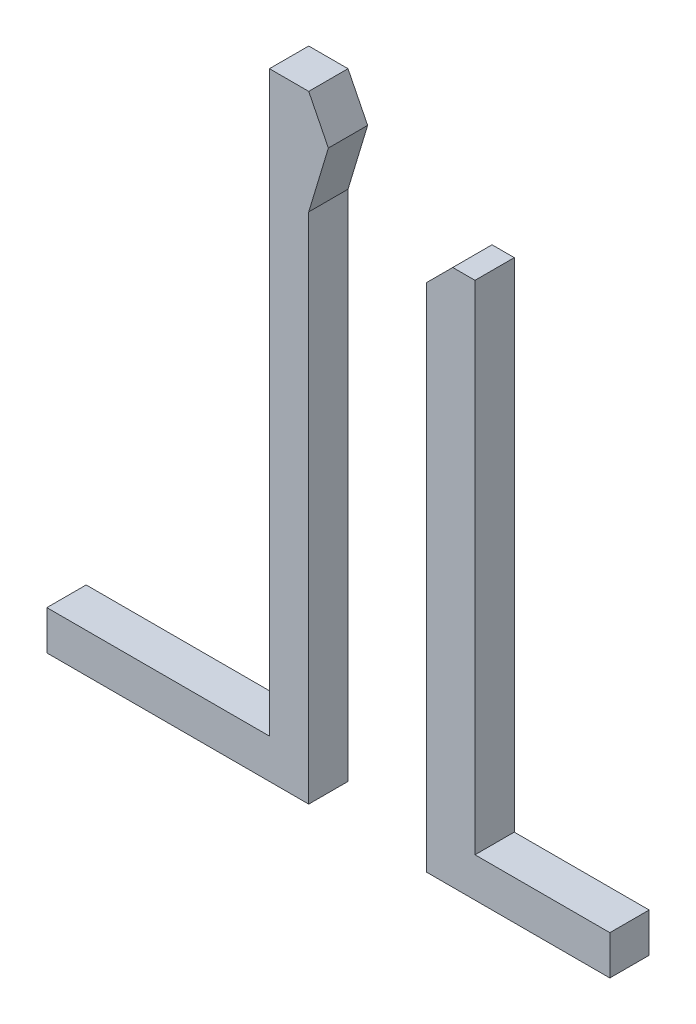
ISO-10303-21;
HEADER;
FILE_DESCRIPTION(('STEP AP214'),'2;1');
FILE_NAME('part.step','',(''),(''),'','','');
FILE_SCHEMA(('AUTOMOTIVE_DESIGN { 1 0 10303 214 1 1 1 1 }'));
ENDSEC;
DATA;
#1=APPLICATION_CONTEXT('core data for automotive mechanical design processes');
#2=APPLICATION_PROTOCOL_DEFINITION('international standard','automotive_design',2000,#1);
#3=PRODUCT_CONTEXT('',#1,'mechanical');
#4=PRODUCT('Part','Part','',(#3));
#5=PRODUCT_RELATED_PRODUCT_CATEGORY('part','',(#4));
#6=PRODUCT_DEFINITION_FORMATION('','',#4);
#7=PRODUCT_DEFINITION_CONTEXT('part definition',#1,'design');
#8=PRODUCT_DEFINITION('design','',#6,#7);
#9=PRODUCT_DEFINITION_SHAPE('','',#8);
#10=(LENGTH_UNIT() NAMED_UNIT(*) SI_UNIT(.MILLI.,.METRE.));
#11=(NAMED_UNIT(*) PLANE_ANGLE_UNIT() SI_UNIT($,.RADIAN.));
#12=(NAMED_UNIT(*) SI_UNIT($,.STERADIAN.) SOLID_ANGLE_UNIT());
#13=UNCERTAINTY_MEASURE_WITH_UNIT(LENGTH_MEASURE(1.E-05),#10,'distance_accuracy_value','');
#14=(GEOMETRIC_REPRESENTATION_CONTEXT(3) GLOBAL_UNCERTAINTY_ASSIGNED_CONTEXT((#13)) GLOBAL_UNIT_ASSIGNED_CONTEXT((#10,
#11,#12)) REPRESENTATION_CONTEXT('',''));
#15=CARTESIAN_POINT('',(0.,0.,0.));
#16=DIRECTION('',(0.,0.,1.));
#17=DIRECTION('',(1.,0.,0.));
#18=AXIS2_PLACEMENT_3D('',#15,#16,#17);
#19=CARTESIAN_POINT('',(0.,0.,0.3));
#20=DIRECTION('',(0.,0.,1.));
#21=DIRECTION('',(1.,0.,0.));
#22=AXIS2_PLACEMENT_3D('',#19,#20,#21);
#23=PLANE('',#22);
#24=DIRECTION('',(0.,1.,0.));
#25=VECTOR('',#24,1.);
#26=CARTESIAN_POINT('',(-0.65,4.61481667929813,0.3));
#27=LINE('',#26,#25);
#28=CARTESIAN_POINT('',(-0.65,4.61481667929813,0.3));
#29=VERTEX_POINT('',#28);
#30=CARTESIAN_POINT('',(-0.65,0.2,0.3));
#31=VERTEX_POINT('',#30);
#32=EDGE_CURVE('P0_E84',#29,#31,#27,.F.);
#33=ORIENTED_EDGE('',*,*,#32,.T.);
#34=DIRECTION('',(1.,0.,0.));
#35=VECTOR('',#34,1.);
#36=CARTESIAN_POINT('',(0.,0.2,0.3));
#37=LINE('',#36,#35);
#38=CARTESIAN_POINT('',(-2.35,0.2,0.3));
#39=VERTEX_POINT('',#38);
#40=EDGE_CURVE('P0_E82',#31,#39,#37,.F.);
#41=ORIENTED_EDGE('',*,*,#40,.T.);
#42=DIRECTION('',(0.,1.,0.));
#43=VECTOR('',#42,1.);
#44=CARTESIAN_POINT('',(-2.35,0.,0.3));
#45=LINE('',#44,#43);
#46=CARTESIAN_POINT('',(-2.35,-0.1,0.3));
#47=VERTEX_POINT('',#46);
#48=EDGE_CURVE('P0_E20',#39,#47,#45,.F.);
#49=ORIENTED_EDGE('',*,*,#48,.T.);
#50=DIRECTION('',(1.,0.,0.));
#51=VECTOR('',#50,1.);
#52=CARTESIAN_POINT('',(-2.35,-0.1,0.3));
#53=LINE('',#52,#51);
#54=CARTESIAN_POINT('',(-0.35,-0.1,0.3));
#55=VERTEX_POINT('',#54);
#56=EDGE_CURVE('P0_E78',#47,#55,#53,.T.);
#57=ORIENTED_EDGE('',*,*,#56,.T.);
#58=DIRECTION('',(0.,1.,0.));
#59=VECTOR('',#58,1.);
#60=CARTESIAN_POINT('',(-0.35,-0.1,0.3));
#61=LINE('',#60,#59);
#62=CARTESIAN_POINT('',(-0.35,3.81740715259392,0.3));
#63=VERTEX_POINT('',#62);
#64=EDGE_CURVE('P0_E124',#55,#63,#61,.T.);
#65=ORIENTED_EDGE('',*,*,#64,.T.);
#66=DIRECTION('',(-0.288719923203956,-0.957413602339711,0.));
#67=VECTOR('',#66,1.);
#68=CARTESIAN_POINT('',(-0.2,4.31481667929813,0.3));
#69=LINE('',#68,#67);
#70=CARTESIAN_POINT('',(-0.2,4.31481667929813,0.3));
#71=VERTEX_POINT('',#70);
#72=EDGE_CURVE('P0_E119',#63,#71,#69,.F.);
#73=ORIENTED_EDGE('',*,*,#72,.T.);
#74=DIRECTION('',(0.447213595499958,-0.894427190999916,0.));
#75=VECTOR('',#74,1.);
#76=CARTESIAN_POINT('',(-0.35,4.61481667929813,0.3));
#77=LINE('',#76,#75);
#78=CARTESIAN_POINT('',(-0.35,4.61481667929813,0.3));
#79=VERTEX_POINT('',#78);
#80=EDGE_CURVE('P0_E114',#71,#79,#77,.F.);
#81=ORIENTED_EDGE('',*,*,#80,.T.);
#82=DIRECTION('',(1.,0.,0.));
#83=VECTOR('',#82,1.);
#84=CARTESIAN_POINT('',(-0.35,4.61481667929813,0.3));
#85=LINE('',#84,#83);
#86=EDGE_CURVE('P0_E109',#79,#29,#85,.F.);
#87=ORIENTED_EDGE('',*,*,#86,.T.);
#88=EDGE_LOOP('',(#33,#41,#49,#57,#65,#73,#81,#87));
#89=FACE_BOUND('',#88,.T.);
#90=ADVANCED_FACE('P0_F17',(#89),#23,.T.);
#91=CARTESIAN_POINT('',(-2.35,-0.1,0.3));
#92=DIRECTION('',(0.,1.,0.));
#93=DIRECTION('',(0.,0.,1.));
#94=AXIS2_PLACEMENT_3D('',#91,#92,#93);
#95=PLANE('',#94);
#96=DIRECTION('',(0.,0.,1.));
#97=VECTOR('',#96,1.);
#98=CARTESIAN_POINT('',(-0.35,-0.1,0.3));
#99=LINE('',#98,#97);
#100=CARTESIAN_POINT('',(-0.35,-0.1,0.));
#101=VERTEX_POINT('',#100);
#102=EDGE_CURVE('P0_E126',#101,#55,#99,.T.);
#103=ORIENTED_EDGE('',*,*,#102,.T.);
#104=ORIENTED_EDGE('',*,*,#56,.F.);
#105=DIRECTION('',(0.,0.,-1.));
#106=VECTOR('',#105,1.);
#107=CARTESIAN_POINT('',(-2.35,-0.1,0.3));
#108=LINE('',#107,#106);
#109=CARTESIAN_POINT('',(-2.35,-0.1,0.));
#110=VERTEX_POINT('',#109);
#111=EDGE_CURVE('P0_E90',#47,#110,#108,.T.);
#112=ORIENTED_EDGE('',*,*,#111,.T.);
#113=DIRECTION('',(1.,0.,0.));
#114=VECTOR('',#113,1.);
#115=CARTESIAN_POINT('',(0.,-0.1,0.));
#116=LINE('',#115,#114);
#117=EDGE_CURVE('P0_E98',#110,#101,#116,.T.);
#118=ORIENTED_EDGE('',*,*,#117,.T.);
#119=EDGE_LOOP('',(#103,#104,#112,#118));
#120=FACE_BOUND('',#119,.T.);
#121=ADVANCED_FACE('P0_F129',(#120),#95,.F.);
#122=CARTESIAN_POINT('',(-0.35,-0.1,0.3));
#123=DIRECTION('',(-1.,0.,0.));
#124=DIRECTION('',(0.,0.,1.));
#125=AXIS2_PLACEMENT_3D('',#122,#123,#124);
#126=PLANE('',#125);
#127=DIRECTION('',(0.,0.,1.));
#128=VECTOR('',#127,1.);
#129=CARTESIAN_POINT('',(-0.35,3.81740715259392,0.3));
#130=LINE('',#129,#128);
#131=CARTESIAN_POINT('',(-0.35,3.81740715259392,0.));
#132=VERTEX_POINT('',#131);
#133=EDGE_CURVE('P0_E121',#132,#63,#130,.T.);
#134=ORIENTED_EDGE('',*,*,#133,.T.);
#135=ORIENTED_EDGE('',*,*,#64,.F.);
#136=ORIENTED_EDGE('',*,*,#102,.F.);
#137=DIRECTION('',(0.,1.,0.));
#138=VECTOR('',#137,1.);
#139=CARTESIAN_POINT('',(-0.35,0.,0.));
#140=LINE('',#139,#138);
#141=EDGE_CURVE('P0_E100',#101,#132,#140,.T.);
#142=ORIENTED_EDGE('',*,*,#141,.T.);
#143=EDGE_LOOP('',(#134,#135,#136,#142));
#144=FACE_BOUND('',#143,.T.);
#145=ADVANCED_FACE('P0_F133',(#144),#126,.F.);
#146=CARTESIAN_POINT('',(-0.2,4.31481667929813,0.3));
#147=DIRECTION('',(-0.957413602339711,0.288719923203956,0.));
#148=DIRECTION('',(-0.288719923203956,-0.957413602339711,0.));
#149=AXIS2_PLACEMENT_3D('',#146,#147,#148);
#150=PLANE('',#149);
#151=DIRECTION('',(0.,0.,1.));
#152=VECTOR('',#151,1.);
#153=CARTESIAN_POINT('',(-0.2,4.31481667929813,0.3));
#154=LINE('',#153,#152);
#155=CARTESIAN_POINT('',(-0.2,4.31481667929813,0.));
#156=VERTEX_POINT('',#155);
#157=EDGE_CURVE('P0_E116',#156,#71,#154,.T.);
#158=ORIENTED_EDGE('',*,*,#157,.T.);
#159=ORIENTED_EDGE('',*,*,#72,.F.);
#160=ORIENTED_EDGE('',*,*,#133,.F.);
#161=DIRECTION('',(0.288719923203956,0.957413602339711,0.));
#162=VECTOR('',#161,1.);
#163=CARTESIAN_POINT('',(-0.35,3.81740715259392,0.));
#164=LINE('',#163,#162);
#165=EDGE_CURVE('P0_E139',#132,#156,#164,.T.);
#166=ORIENTED_EDGE('',*,*,#165,.T.);
#167=EDGE_LOOP('',(#158,#159,#160,#166));
#168=FACE_BOUND('',#167,.T.);
#169=ADVANCED_FACE('P0_F162',(#168),#150,.F.);
#170=CARTESIAN_POINT('',(-0.35,4.61481667929813,0.3));
#171=DIRECTION('',(-0.894427190999916,-0.447213595499958,0.));
#172=DIRECTION('',(0.447213595499958,-0.894427190999916,0.));
#173=AXIS2_PLACEMENT_3D('',#170,#171,#172);
#174=PLANE('',#173);
#175=DIRECTION('',(0.,0.,-1.));
#176=VECTOR('',#175,1.);
#177=CARTESIAN_POINT('',(-0.35,4.61481667929813,0.3));
#178=LINE('',#177,#176);
#179=CARTESIAN_POINT('',(-0.35,4.61481667929813,0.));
#180=VERTEX_POINT('',#179);
#181=EDGE_CURVE('P0_E111',#180,#79,#178,.F.);
#182=ORIENTED_EDGE('',*,*,#181,.T.);
#183=ORIENTED_EDGE('',*,*,#80,.F.);
#184=ORIENTED_EDGE('',*,*,#157,.F.);
#185=DIRECTION('',(-0.447213595499959,0.894427190999915,0.));
#186=VECTOR('',#185,1.);
#187=CARTESIAN_POINT('',(-0.2,4.31481667929813,0.));
#188=LINE('',#187,#186);
#189=EDGE_CURVE('P0_E140',#156,#180,#188,.T.);
#190=ORIENTED_EDGE('',*,*,#189,.T.);
#191=EDGE_LOOP('',(#182,#183,#184,#190));
#192=FACE_BOUND('',#191,.T.);
#193=ADVANCED_FACE('P0_F160',(#192),#174,.F.);
#194=CARTESIAN_POINT('',(-0.35,4.61481667929813,0.3));
#195=DIRECTION('',(0.,-1.,0.));
#196=DIRECTION('',(0.,0.,-1.));
#197=AXIS2_PLACEMENT_3D('',#194,#195,#196);
#198=PLANE('',#197);
#199=DIRECTION('',(0.,0.,1.));
#200=VECTOR('',#199,1.);
#201=CARTESIAN_POINT('',(-0.65,4.61481667929813,0.3));
#202=LINE('',#201,#200);
#203=CARTESIAN_POINT('',(-0.65,4.61481667929813,0.));
#204=VERTEX_POINT('',#203);
#205=EDGE_CURVE('P0_E106',#204,#29,#202,.T.);
#206=ORIENTED_EDGE('',*,*,#205,.T.);
#207=ORIENTED_EDGE('',*,*,#86,.F.);
#208=ORIENTED_EDGE('',*,*,#181,.F.);
#209=DIRECTION('',(1.,0.,0.));
#210=VECTOR('',#209,1.);
#211=CARTESIAN_POINT('',(0.,4.61481667929813,0.));
#212=LINE('',#211,#210);
#213=EDGE_CURVE('P0_E145',#180,#204,#212,.F.);
#214=ORIENTED_EDGE('',*,*,#213,.T.);
#215=EDGE_LOOP('',(#206,#207,#208,#214));
#216=FACE_BOUND('',#215,.T.);
#217=ADVANCED_FACE('P0_F156',(#216),#198,.F.);
#218=CARTESIAN_POINT('',(-0.65,4.61481667929813,0.3));
#219=DIRECTION('',(1.,0.,0.));
#220=DIRECTION('',(0.,1.,0.));
#221=AXIS2_PLACEMENT_3D('',#218,#219,#220);
#222=PLANE('',#221);
#223=DIRECTION('',(0.,0.,1.));
#224=VECTOR('',#223,1.);
#225=CARTESIAN_POINT('',(-0.65,0.2,0.3));
#226=LINE('',#225,#224);
#227=CARTESIAN_POINT('',(-0.65,0.2,0.));
#228=VERTEX_POINT('',#227);
#229=EDGE_CURVE('P0_E91',#228,#31,#226,.T.);
#230=ORIENTED_EDGE('',*,*,#229,.T.);
#231=ORIENTED_EDGE('',*,*,#32,.F.);
#232=ORIENTED_EDGE('',*,*,#205,.F.);
#233=DIRECTION('',(0.,1.,0.));
#234=VECTOR('',#233,1.);
#235=CARTESIAN_POINT('',(-0.65,0.,0.));
#236=LINE('',#235,#234);
#237=EDGE_CURVE('P0_E148',#204,#228,#236,.F.);
#238=ORIENTED_EDGE('',*,*,#237,.T.);
#239=EDGE_LOOP('',(#230,#231,#232,#238));
#240=FACE_BOUND('',#239,.T.);
#241=ADVANCED_FACE('P0_F153',(#240),#222,.F.);
#242=CARTESIAN_POINT('',(-0.65,0.2,0.3));
#243=DIRECTION('',(0.,-1.,0.));
#244=DIRECTION('',(1.,0.,0.));
#245=AXIS2_PLACEMENT_3D('',#242,#243,#244);
#246=PLANE('',#245);
#247=DIRECTION('',(0.,0.,-1.));
#248=VECTOR('',#247,1.);
#249=CARTESIAN_POINT('',(-2.35,0.2,0.3));
#250=LINE('',#249,#248);
#251=CARTESIAN_POINT('',(-2.35,0.2,0.));
#252=VERTEX_POINT('',#251);
#253=EDGE_CURVE('P0_E34',#252,#39,#250,.F.);
#254=ORIENTED_EDGE('',*,*,#253,.T.);
#255=ORIENTED_EDGE('',*,*,#40,.F.);
#256=ORIENTED_EDGE('',*,*,#229,.F.);
#257=DIRECTION('',(1.,0.,0.));
#258=VECTOR('',#257,1.);
#259=CARTESIAN_POINT('',(0.,0.2,0.));
#260=LINE('',#259,#258);
#261=EDGE_CURVE('P0_E26',#228,#252,#260,.F.);
#262=ORIENTED_EDGE('',*,*,#261,.T.);
#263=EDGE_LOOP('',(#254,#255,#256,#262));
#264=FACE_BOUND('',#263,.T.);
#265=ADVANCED_FACE('P0_F88',(#264),#246,.F.);
#266=CARTESIAN_POINT('',(-2.35,0.2,0.3));
#267=DIRECTION('',(1.,0.,0.));
#268=DIRECTION('',(0.,0.,-1.));
#269=AXIS2_PLACEMENT_3D('',#266,#267,#268);
#270=PLANE('',#269);
#271=ORIENTED_EDGE('',*,*,#111,.F.);
#272=ORIENTED_EDGE('',*,*,#48,.F.);
#273=ORIENTED_EDGE('',*,*,#253,.F.);
#274=DIRECTION('',(0.,1.,0.));
#275=VECTOR('',#274,1.);
#276=CARTESIAN_POINT('',(-2.35,0.,0.));
#277=LINE('',#276,#275);
#278=EDGE_CURVE('P0_E11',#252,#110,#277,.F.);
#279=ORIENTED_EDGE('',*,*,#278,.T.);
#280=EDGE_LOOP('',(#271,#272,#273,#279));
#281=FACE_BOUND('',#280,.T.);
#282=ADVANCED_FACE('P0_F94',(#281),#270,.F.);
#283=CARTESIAN_POINT('',(0.,0.,0.));
#284=DIRECTION('',(0.,0.,1.));
#285=DIRECTION('',(1.,0.,0.));
#286=AXIS2_PLACEMENT_3D('',#283,#284,#285);
#287=PLANE('',#286);
#288=ORIENTED_EDGE('',*,*,#261,.F.);
#289=ORIENTED_EDGE('',*,*,#237,.F.);
#290=ORIENTED_EDGE('',*,*,#213,.F.);
#291=ORIENTED_EDGE('',*,*,#189,.F.);
#292=ORIENTED_EDGE('',*,*,#165,.F.);
#293=ORIENTED_EDGE('',*,*,#141,.F.);
#294=ORIENTED_EDGE('',*,*,#117,.F.);
#295=ORIENTED_EDGE('',*,*,#278,.F.);
#296=EDGE_LOOP('',(#288,#289,#290,#291,#292,#293,#294,#295));
#297=FACE_BOUND('',#296,.T.);
#298=ADVANCED_FACE('P0_F136',(#297),#287,.F.);
#299=CLOSED_SHELL('',(#90,#121,#145,#169,#193,#217,#241,#265,#282,#298));
#300=MANIFOLD_SOLID_BREP('P0_B1',#299);
#301=CARTESIAN_POINT('',(0.,0.,0.));
#302=DIRECTION('',(0.,0.,-1.));
#303=DIRECTION('',(-1.,0.,0.));
#304=AXIS2_PLACEMENT_3D('',#301,#302,#303);
#305=PLANE('',#304);
#306=DIRECTION('',(0.,-1.,0.));
#307=VECTOR('',#306,1.);
#308=CARTESIAN_POINT('',(0.92,4.,0.));
#309=LINE('',#308,#307);
#310=CARTESIAN_POINT('',(0.92,4.,0.));
#311=VERTEX_POINT('',#310);
#312=CARTESIAN_POINT('',(0.92,0.2,0.));
#313=VERTEX_POINT('',#312);
#314=EDGE_CURVE('P1_E78',#311,#313,#309,.T.);
#315=ORIENTED_EDGE('',*,*,#314,.T.);
#316=DIRECTION('',(-1.,0.,0.));
#317=VECTOR('',#316,1.);
#318=CARTESIAN_POINT('',(0.,0.2,0.));
#319=LINE('',#318,#317);
#320=CARTESIAN_POINT('',(1.95,0.2,0.));
#321=VERTEX_POINT('',#320);
#322=EDGE_CURVE('P1_E76',#313,#321,#319,.F.);
#323=ORIENTED_EDGE('',*,*,#322,.T.);
#324=DIRECTION('',(0.,1.,0.));
#325=VECTOR('',#324,1.);
#326=CARTESIAN_POINT('',(1.95,0.,0.));
#327=LINE('',#326,#325);
#328=CARTESIAN_POINT('',(1.95,-0.1,0.));
#329=VERTEX_POINT('',#328);
#330=EDGE_CURVE('P1_E20',#321,#329,#327,.F.);
#331=ORIENTED_EDGE('',*,*,#330,.T.);
#332=DIRECTION('',(-1.,0.,0.));
#333=VECTOR('',#332,1.);
#334=CARTESIAN_POINT('',(1.95,-0.1,0.));
#335=LINE('',#334,#333);
#336=CARTESIAN_POINT('',(0.55,-0.1,0.));
#337=VERTEX_POINT('',#336);
#338=EDGE_CURVE('P1_E72',#329,#337,#335,.T.);
#339=ORIENTED_EDGE('',*,*,#338,.T.);
#340=DIRECTION('',(0.,1.,0.));
#341=VECTOR('',#340,1.);
#342=CARTESIAN_POINT('',(0.55,-0.1,0.));
#343=LINE('',#342,#341);
#344=CARTESIAN_POINT('',(0.55,3.8,0.));
#345=VERTEX_POINT('',#344);
#346=EDGE_CURVE('P1_E111',#337,#345,#343,.T.);
#347=ORIENTED_EDGE('',*,*,#346,.T.);
#348=DIRECTION('',(0.707106781186547,0.707106781186548,0.));
#349=VECTOR('',#348,1.);
#350=CARTESIAN_POINT('',(0.55,3.8,0.));
#351=LINE('',#350,#349);
#352=CARTESIAN_POINT('',(0.75,4.,0.));
#353=VERTEX_POINT('',#352);
#354=EDGE_CURVE('P1_E106',#345,#353,#351,.T.);
#355=ORIENTED_EDGE('',*,*,#354,.T.);
#356=DIRECTION('',(1.,0.,0.));
#357=VECTOR('',#356,1.);
#358=CARTESIAN_POINT('',(0.75,4.,0.));
#359=LINE('',#358,#357);
#360=EDGE_CURVE('P1_E101',#353,#311,#359,.T.);
#361=ORIENTED_EDGE('',*,*,#360,.T.);
#362=EDGE_LOOP('',(#315,#323,#331,#339,#347,#355,#361));
#363=FACE_BOUND('',#362,.T.);
#364=ADVANCED_FACE('P1_F17',(#363),#305,.T.);
#365=CARTESIAN_POINT('',(1.95,-0.1,0.3));
#366=DIRECTION('',(0.,1.,0.));
#367=DIRECTION('',(-1.,0.,0.));
#368=AXIS2_PLACEMENT_3D('',#365,#366,#367);
#369=PLANE('',#368);
#370=DIRECTION('',(0.,0.,1.));
#371=VECTOR('',#370,1.);
#372=CARTESIAN_POINT('',(1.95,-0.1,0.3));
#373=LINE('',#372,#371);
#374=CARTESIAN_POINT('',(1.95,-0.1,0.3));
#375=VERTEX_POINT('',#374);
#376=EDGE_CURVE('P1_E85',#329,#375,#373,.T.);
#377=ORIENTED_EDGE('',*,*,#376,.T.);
#378=DIRECTION('',(-1.,0.,0.));
#379=VECTOR('',#378,1.);
#380=CARTESIAN_POINT('',(0.,-0.1,0.3));
#381=LINE('',#380,#379);
#382=CARTESIAN_POINT('',(0.55,-0.1,0.3));
#383=VERTEX_POINT('',#382);
#384=EDGE_CURVE('P1_E84',#375,#383,#381,.T.);
#385=ORIENTED_EDGE('',*,*,#384,.T.);
#386=DIRECTION('',(0.,0.,-1.));
#387=VECTOR('',#386,1.);
#388=CARTESIAN_POINT('',(0.55,-0.1,0.3));
#389=LINE('',#388,#387);
#390=EDGE_CURVE('P1_E113',#383,#337,#389,.T.);
#391=ORIENTED_EDGE('',*,*,#390,.T.);
#392=ORIENTED_EDGE('',*,*,#338,.F.);
#393=EDGE_LOOP('',(#377,#385,#391,#392));
#394=FACE_BOUND('',#393,.T.);
#395=ADVANCED_FACE('P1_F116',(#394),#369,.F.);
#396=CARTESIAN_POINT('',(0.55,-0.1,0.3));
#397=DIRECTION('',(1.,0.,0.));
#398=DIRECTION('',(0.,0.,-1.));
#399=AXIS2_PLACEMENT_3D('',#396,#397,#398);
#400=PLANE('',#399);
#401=ORIENTED_EDGE('',*,*,#390,.F.);
#402=DIRECTION('',(0.,1.,0.));
#403=VECTOR('',#402,1.);
#404=CARTESIAN_POINT('',(0.55,0.,0.3));
#405=LINE('',#404,#403);
#406=CARTESIAN_POINT('',(0.55,3.8,0.3));
#407=VERTEX_POINT('',#406);
#408=EDGE_CURVE('P1_E121',#383,#407,#405,.T.);
#409=ORIENTED_EDGE('',*,*,#408,.T.);
#410=DIRECTION('',(0.,0.,1.));
#411=VECTOR('',#410,1.);
#412=CARTESIAN_POINT('',(0.55,3.8,0.3));
#413=LINE('',#412,#411);
#414=EDGE_CURVE('P1_E108',#407,#345,#413,.F.);
#415=ORIENTED_EDGE('',*,*,#414,.T.);
#416=ORIENTED_EDGE('',*,*,#346,.F.);
#417=EDGE_LOOP('',(#401,#409,#415,#416));
#418=FACE_BOUND('',#417,.T.);
#419=ADVANCED_FACE('P1_F120',(#418),#400,.F.);
#420=CARTESIAN_POINT('',(0.55,3.8,0.3));
#421=DIRECTION('',(0.707106781186548,-0.707106781186547,0.));
#422=DIRECTION('',(0.707106781186547,0.707106781186548,0.));
#423=AXIS2_PLACEMENT_3D('',#420,#421,#422);
#424=PLANE('',#423);
#425=ORIENTED_EDGE('',*,*,#414,.F.);
#426=DIRECTION('',(0.707106781186547,0.707106781186548,0.));
#427=VECTOR('',#426,1.);
#428=CARTESIAN_POINT('',(0.55,3.8,0.3));
#429=LINE('',#428,#427);
#430=CARTESIAN_POINT('',(0.75,4.,0.3));
#431=VERTEX_POINT('',#430);
#432=EDGE_CURVE('P1_E127',#407,#431,#429,.T.);
#433=ORIENTED_EDGE('',*,*,#432,.T.);
#434=DIRECTION('',(0.,0.,-1.));
#435=VECTOR('',#434,1.);
#436=CARTESIAN_POINT('',(0.75,4.,0.3));
#437=LINE('',#436,#435);
#438=EDGE_CURVE('P1_E103',#431,#353,#437,.T.);
#439=ORIENTED_EDGE('',*,*,#438,.T.);
#440=ORIENTED_EDGE('',*,*,#354,.F.);
#441=EDGE_LOOP('',(#425,#433,#439,#440));
#442=FACE_BOUND('',#441,.T.);
#443=ADVANCED_FACE('P1_F145',(#442),#424,.F.);
#444=CARTESIAN_POINT('',(0.75,4.,0.3));
#445=DIRECTION('',(0.,-1.,0.));
#446=DIRECTION('',(0.,0.,-1.));
#447=AXIS2_PLACEMENT_3D('',#444,#445,#446);
#448=PLANE('',#447);
#449=ORIENTED_EDGE('',*,*,#438,.F.);
#450=DIRECTION('',(-1.,0.,0.));
#451=VECTOR('',#450,1.);
#452=CARTESIAN_POINT('',(0.,4.,0.3));
#453=LINE('',#452,#451);
#454=CARTESIAN_POINT('',(0.92,4.,0.3));
#455=VERTEX_POINT('',#454);
#456=EDGE_CURVE('P1_E129',#431,#455,#453,.F.);
#457=ORIENTED_EDGE('',*,*,#456,.T.);
#458=DIRECTION('',(0.,0.,1.));
#459=VECTOR('',#458,1.);
#460=CARTESIAN_POINT('',(0.92,4.,0.3));
#461=LINE('',#460,#459);
#462=EDGE_CURVE('P1_E98',#455,#311,#461,.F.);
#463=ORIENTED_EDGE('',*,*,#462,.T.);
#464=ORIENTED_EDGE('',*,*,#360,.F.);
#465=EDGE_LOOP('',(#449,#457,#463,#464));
#466=FACE_BOUND('',#465,.T.);
#467=ADVANCED_FACE('P1_F141',(#466),#448,.F.);
#468=CARTESIAN_POINT('',(0.92,4.,0.3));
#469=DIRECTION('',(-1.,0.,0.));
#470=DIRECTION('',(0.,-1.,0.));
#471=AXIS2_PLACEMENT_3D('',#468,#469,#470);
#472=PLANE('',#471);
#473=ORIENTED_EDGE('',*,*,#462,.F.);
#474=DIRECTION('',(0.,1.,0.));
#475=VECTOR('',#474,1.);
#476=CARTESIAN_POINT('',(0.92,0.,0.3));
#477=LINE('',#476,#475);
#478=CARTESIAN_POINT('',(0.92,0.2,0.3));
#479=VERTEX_POINT('',#478);
#480=EDGE_CURVE('P1_E134',#455,#479,#477,.F.);
#481=ORIENTED_EDGE('',*,*,#480,.T.);
#482=DIRECTION('',(0.,0.,-1.));
#483=VECTOR('',#482,1.);
#484=CARTESIAN_POINT('',(0.92,0.2,0.3));
#485=LINE('',#484,#483);
#486=EDGE_CURVE('P1_E92',#479,#313,#485,.T.);
#487=ORIENTED_EDGE('',*,*,#486,.T.);
#488=ORIENTED_EDGE('',*,*,#314,.F.);
#489=EDGE_LOOP('',(#473,#481,#487,#488));
#490=FACE_BOUND('',#489,.T.);
#491=ADVANCED_FACE('P1_F139',(#490),#472,.F.);
#492=CARTESIAN_POINT('',(0.92,0.2,0.3));
#493=DIRECTION('',(0.,-1.,0.));
#494=DIRECTION('',(0.,0.,-1.));
#495=AXIS2_PLACEMENT_3D('',#492,#493,#494);
#496=PLANE('',#495);
#497=ORIENTED_EDGE('',*,*,#486,.F.);
#498=DIRECTION('',(-1.,0.,0.));
#499=VECTOR('',#498,1.);
#500=CARTESIAN_POINT('',(0.,0.2,0.3));
#501=LINE('',#500,#499);
#502=CARTESIAN_POINT('',(1.95,0.2,0.3));
#503=VERTEX_POINT('',#502);
#504=EDGE_CURVE('P1_E26',#479,#503,#501,.F.);
#505=ORIENTED_EDGE('',*,*,#504,.T.);
#506=DIRECTION('',(0.,0.,1.));
#507=VECTOR('',#506,1.);
#508=CARTESIAN_POINT('',(1.95,0.2,0.3));
#509=LINE('',#508,#507);
#510=EDGE_CURVE('P1_E34',#503,#321,#509,.F.);
#511=ORIENTED_EDGE('',*,*,#510,.T.);
#512=ORIENTED_EDGE('',*,*,#322,.F.);
#513=EDGE_LOOP('',(#497,#505,#511,#512));
#514=FACE_BOUND('',#513,.T.);
#515=ADVANCED_FACE('P1_F82',(#514),#496,.F.);
#516=CARTESIAN_POINT('',(1.95,0.2,0.3));
#517=DIRECTION('',(-1.,0.,0.));
#518=DIRECTION('',(0.,0.,1.));
#519=AXIS2_PLACEMENT_3D('',#516,#517,#518);
#520=PLANE('',#519);
#521=ORIENTED_EDGE('',*,*,#510,.F.);
#522=DIRECTION('',(0.,1.,0.));
#523=VECTOR('',#522,1.);
#524=CARTESIAN_POINT('',(1.95,0.,0.3));
#525=LINE('',#524,#523);
#526=EDGE_CURVE('P1_E11',#503,#375,#525,.F.);
#527=ORIENTED_EDGE('',*,*,#526,.T.);
#528=ORIENTED_EDGE('',*,*,#376,.F.);
#529=ORIENTED_EDGE('',*,*,#330,.F.);
#530=EDGE_LOOP('',(#521,#527,#528,#529));
#531=FACE_BOUND('',#530,.T.);
#532=ADVANCED_FACE('P1_F88',(#531),#520,.F.);
#533=CARTESIAN_POINT('',(0.,0.,0.3));
#534=DIRECTION('',(0.,0.,-1.));
#535=DIRECTION('',(-1.,0.,0.));
#536=AXIS2_PLACEMENT_3D('',#533,#534,#535);
#537=PLANE('',#536);
#538=ORIENTED_EDGE('',*,*,#504,.F.);
#539=ORIENTED_EDGE('',*,*,#480,.F.);
#540=ORIENTED_EDGE('',*,*,#456,.F.);
#541=ORIENTED_EDGE('',*,*,#432,.F.);
#542=ORIENTED_EDGE('',*,*,#408,.F.);
#543=ORIENTED_EDGE('',*,*,#384,.F.);
#544=ORIENTED_EDGE('',*,*,#526,.F.);
#545=EDGE_LOOP('',(#538,#539,#540,#541,#542,#543,#544));
#546=FACE_BOUND('',#545,.T.);
#547=ADVANCED_FACE('P1_F124',(#546),#537,.F.);
#548=CLOSED_SHELL('',(#364,#395,#419,#443,#467,#491,#515,#532,#547));
#549=MANIFOLD_SOLID_BREP('P1_B1',#548);
#550=ADVANCED_BREP_SHAPE_REPRESENTATION('',(#18,#300,#549),#14);
#551=SHAPE_DEFINITION_REPRESENTATION(#9,#550);
ENDSEC;
END-ISO-10303-21;
